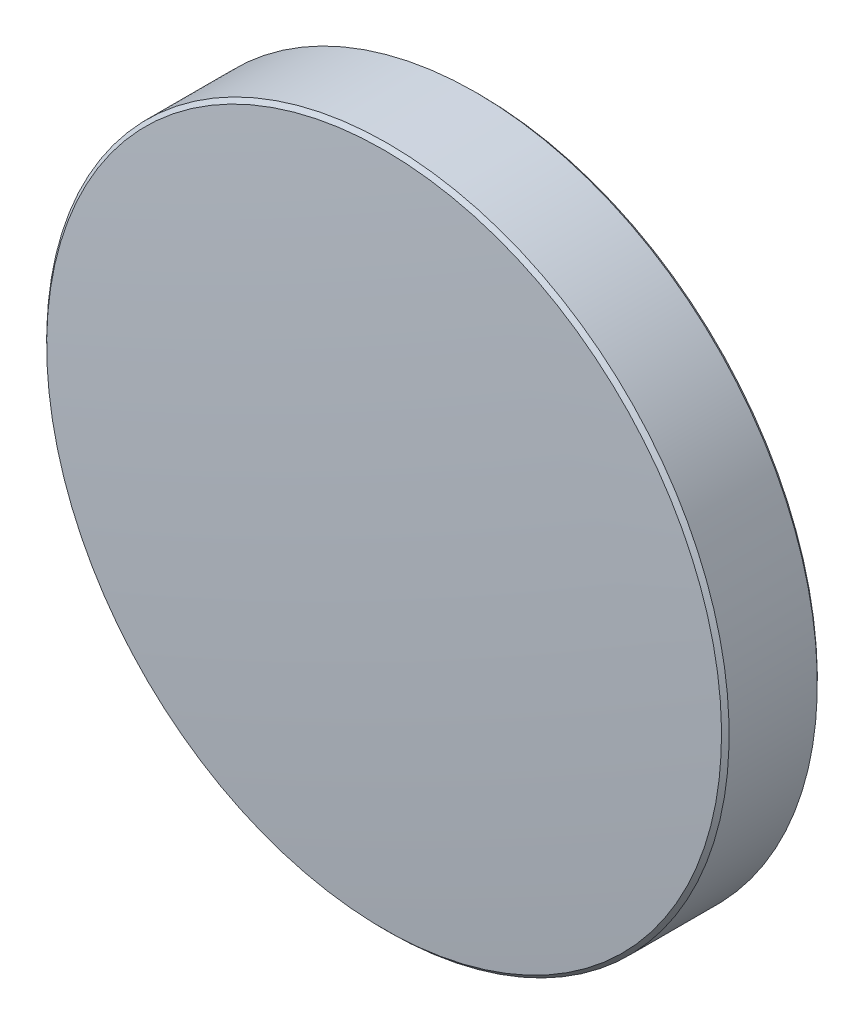
ISO-10303-21;
HEADER;
FILE_DESCRIPTION(('STEP AP214'),'2;1');
FILE_NAME('part.step','',(''),(''),'','','');
FILE_SCHEMA(('AUTOMOTIVE_DESIGN { 1 0 10303 214 1 1 1 1 }'));
ENDSEC;
DATA;
#1=APPLICATION_CONTEXT('core data for automotive mechanical design processes');
#2=APPLICATION_PROTOCOL_DEFINITION('international standard','automotive_design',2000,#1);
#3=PRODUCT_CONTEXT('',#1,'mechanical');
#4=PRODUCT('Part','Part','',(#3));
#5=PRODUCT_RELATED_PRODUCT_CATEGORY('part','',(#4));
#6=PRODUCT_DEFINITION_FORMATION('','',#4);
#7=PRODUCT_DEFINITION_CONTEXT('part definition',#1,'design');
#8=PRODUCT_DEFINITION('design','',#6,#7);
#9=PRODUCT_DEFINITION_SHAPE('','',#8);
#10=(LENGTH_UNIT() NAMED_UNIT(*) SI_UNIT(.MILLI.,.METRE.));
#11=(NAMED_UNIT(*) PLANE_ANGLE_UNIT() SI_UNIT($,.RADIAN.));
#12=(NAMED_UNIT(*) SI_UNIT($,.STERADIAN.) SOLID_ANGLE_UNIT());
#13=UNCERTAINTY_MEASURE_WITH_UNIT(LENGTH_MEASURE(1.E-05),#10,'distance_accuracy_value','');
#14=(GEOMETRIC_REPRESENTATION_CONTEXT(3) GLOBAL_UNCERTAINTY_ASSIGNED_CONTEXT((#13)) GLOBAL_UNIT_ASSIGNED_CONTEXT((#10,
#11,#12)) REPRESENTATION_CONTEXT('',''));
#15=CARTESIAN_POINT('',(0.,0.,0.));
#16=DIRECTION('',(0.,0.,1.));
#17=DIRECTION('',(1.,0.,0.));
#18=AXIS2_PLACEMENT_3D('',#15,#16,#17);
#19=CARTESIAN_POINT('',(0.,0.,-2.));
#20=DIRECTION('',(0.,0.,-1.));
#21=DIRECTION('',(0.,1.,0.));
#22=AXIS2_PLACEMENT_3D('',#19,#20,#21);
#23=PLANE('',#22);
#24=CARTESIAN_POINT('',(0.,0.,-2.));
#25=DIRECTION('',(0.,0.,-1.));
#26=DIRECTION('',(0.,1.,0.));
#27=AXIS2_PLACEMENT_3D('',#24,#25,#26);
#28=CIRCLE('',#27,12.5585786437627);
#29=CARTESIAN_POINT('',(0.,12.5585786437627,-2.));
#30=VERTEX_POINT('',#29);
#31=EDGE_CURVE('E27',#30,#30,#28,.T.);
#32=ORIENTED_EDGE('',*,*,#31,.T.);
#33=EDGE_LOOP('',(#32));
#34=FACE_BOUND('',#33,.T.);
#35=ADVANCED_FACE('F13',(#34),#23,.T.);
#36=CARTESIAN_POINT('',(0.,0.,-179.9));
#37=DIRECTION('',(0.,0.,-1.));
#38=DIRECTION('',(0.,1.,0.));
#39=AXIS2_PLACEMENT_3D('',#36,#37,#38);
#40=SPHERICAL_SURFACE('',#39,181.9);
#41=CARTESIAN_POINT('',(0.,0.,1.56595301171078));
#42=DIRECTION('',(0.,0.,-1.));
#43=DIRECTION('',(0.,1.,0.));
#44=AXIS2_PLACEMENT_3D('',#41,#42,#43);
#45=CIRCLE('',#44,12.5585786437627);
#46=CARTESIAN_POINT('',(0.,12.5585786437627,1.56595301171078));
#47=VERTEX_POINT('',#46);
#48=EDGE_CURVE('E9',#47,#47,#45,.T.);
#49=ORIENTED_EDGE('',*,*,#48,.F.);
#50=EDGE_LOOP('',(#49));
#51=FACE_BOUND('',#50,.T.);
#52=ADVANCED_FACE('F46',(#51),#40,.T.);
#53=CARTESIAN_POINT('',(0.,0.,1.42453165547352));
#54=DIRECTION('',(0.,0.,-1.));
#55=DIRECTION('',(0.,1.,0.));
#56=AXIS2_PLACEMENT_3D('',#53,#54,#55);
#57=CONICAL_SURFACE('',#56,12.7,0.785398163397665);
#58=ORIENTED_EDGE('',*,*,#48,.T.);
#59=EDGE_LOOP('',(#58));
#60=FACE_BOUND('',#59,.T.);
#61=CARTESIAN_POINT('',(0.,0.,1.42453165547352));
#62=DIRECTION('',(0.,0.,-1.));
#63=DIRECTION('',(0.,1.,0.));
#64=AXIS2_PLACEMENT_3D('',#61,#62,#63);
#65=CIRCLE('',#64,12.7);
#66=CARTESIAN_POINT('',(0.,12.7,1.42453165547353));
#67=VERTEX_POINT('',#66);
#68=EDGE_CURVE('E19',#67,#67,#65,.T.);
#69=ORIENTED_EDGE('',*,*,#68,.F.);
#70=EDGE_LOOP('',(#69));
#71=FACE_BOUND('',#70,.T.);
#72=ADVANCED_FACE('F43',(#60,#71),#57,.T.);
#73=CARTESIAN_POINT('',(0.,0.,-2.));
#74=DIRECTION('',(0.,0.,-1.));
#75=DIRECTION('',(0.,1.,0.));
#76=AXIS2_PLACEMENT_3D('',#73,#74,#75);
#77=CYLINDRICAL_SURFACE('',#76,12.7);
#78=ORIENTED_EDGE('',*,*,#68,.T.);
#79=EDGE_LOOP('',(#78));
#80=FACE_BOUND('',#79,.T.);
#81=CARTESIAN_POINT('',(0.,0.,-1.85857864376269));
#82=DIRECTION('',(0.,0.,-1.));
#83=DIRECTION('',(0.,1.,0.));
#84=AXIS2_PLACEMENT_3D('',#81,#82,#83);
#85=CIRCLE('',#84,12.7);
#86=CARTESIAN_POINT('',(0.,12.7,-1.85857864376269));
#87=VERTEX_POINT('',#86);
#88=EDGE_CURVE('E23',#87,#87,#85,.T.);
#89=ORIENTED_EDGE('',*,*,#88,.F.);
#90=EDGE_LOOP('',(#89));
#91=FACE_BOUND('',#90,.T.);
#92=ADVANCED_FACE('F36',(#80,#91),#77,.T.);
#93=CARTESIAN_POINT('',(0.,0.,-2.));
#94=DIRECTION('',(0.,0.,1.));
#95=DIRECTION('',(0.,-1.,0.));
#96=AXIS2_PLACEMENT_3D('',#93,#94,#95);
#97=CONICAL_SURFACE('',#96,12.5585786437627,0.785398163397445);
#98=ORIENTED_EDGE('',*,*,#88,.T.);
#99=EDGE_LOOP('',(#98));
#100=FACE_BOUND('',#99,.T.);
#101=ORIENTED_EDGE('',*,*,#31,.F.);
#102=EDGE_LOOP('',(#101));
#103=FACE_BOUND('',#102,.T.);
#104=ADVANCED_FACE('F34',(#100,#103),#97,.T.);
#105=CLOSED_SHELL('',(#35,#52,#72,#92,#104));
#106=MANIFOLD_SOLID_BREP('B1',#105);
#107=ADVANCED_BREP_SHAPE_REPRESENTATION('',(#18,#106),#14);
#108=SHAPE_DEFINITION_REPRESENTATION(#9,#107);
ENDSEC;
END-ISO-10303-21;
